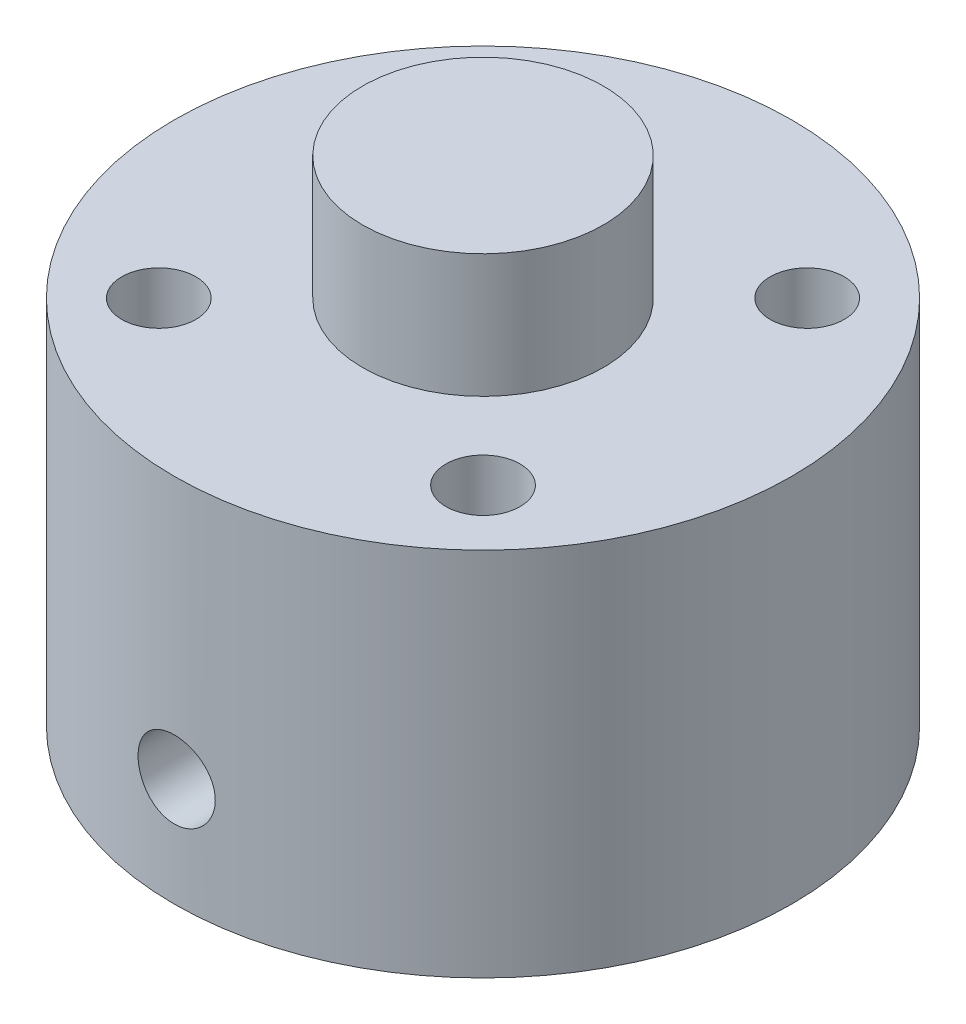
ISO-10303-21;
HEADER;
FILE_DESCRIPTION(('STEP AP214'),'2;1');
FILE_NAME('part.step','',(''),(''),'','','');
FILE_SCHEMA(('AUTOMOTIVE_DESIGN { 1 0 10303 214 1 1 1 1 }'));
ENDSEC;
DATA;
#1=APPLICATION_CONTEXT('core data for automotive mechanical design processes');
#2=APPLICATION_PROTOCOL_DEFINITION('international standard','automotive_design',2000,#1);
#3=PRODUCT_CONTEXT('',#1,'mechanical');
#4=PRODUCT('Part','Part','',(#3));
#5=PRODUCT_RELATED_PRODUCT_CATEGORY('part','',(#4));
#6=PRODUCT_DEFINITION_FORMATION('','',#4);
#7=PRODUCT_DEFINITION_CONTEXT('part definition',#1,'design');
#8=PRODUCT_DEFINITION('design','',#6,#7);
#9=PRODUCT_DEFINITION_SHAPE('','',#8);
#10=(LENGTH_UNIT() NAMED_UNIT(*) SI_UNIT(.MILLI.,.METRE.));
#11=(NAMED_UNIT(*) PLANE_ANGLE_UNIT() SI_UNIT($,.RADIAN.));
#12=(NAMED_UNIT(*) SI_UNIT($,.STERADIAN.) SOLID_ANGLE_UNIT());
#13=UNCERTAINTY_MEASURE_WITH_UNIT(LENGTH_MEASURE(1.E-05),#10,'distance_accuracy_value','');
#14=(GEOMETRIC_REPRESENTATION_CONTEXT(3) GLOBAL_UNCERTAINTY_ASSIGNED_CONTEXT((#13)) GLOBAL_UNIT_ASSIGNED_CONTEXT((#10,
#11,#12)) REPRESENTATION_CONTEXT('',''));
#15=CARTESIAN_POINT('',(0.,0.,0.));
#16=DIRECTION('',(0.,0.,1.));
#17=DIRECTION('',(1.,0.,0.));
#18=AXIS2_PLACEMENT_3D('',#15,#16,#17);
#19=CARTESIAN_POINT('',(0.,12.,0.));
#20=DIRECTION('',(0.,-1.,0.));
#21=DIRECTION('',(0.,0.,-1.));
#22=AXIS2_PLACEMENT_3D('',#19,#20,#21);
#23=CYLINDRICAL_SURFACE('',#22,10.);
#24=CARTESIAN_POINT('',(1.25,3.5,9.92156741649221));
#25=CARTESIAN_POINT('',(1.24999702741697,3.56991814189591,9.92156842085664));
#26=CARTESIAN_POINT('',(1.24411394951064,3.63987998245241,9.92231447559473));
#27=CARTESIAN_POINT('',(1.22073820686067,3.7778566127023,9.92521695489986));
#28=CARTESIAN_POINT('',(1.20323341054565,3.84586929024852,9.92737485321481));
#29=CARTESIAN_POINT('',(1.15713834641298,3.97792994105802,9.93285286887713));
#30=CARTESIAN_POINT('',(1.12855560239912,4.04198057105933,9.93617219726825));
#31=CARTESIAN_POINT('',(1.06113209921476,4.16436422591154,9.94359811759954));
#32=CARTESIAN_POINT('',(1.0222930936874,4.22269822587153,9.94770457492142));
#33=CARTESIAN_POINT('',(0.935226725132209,4.33233112356106,9.9562677962195));
#34=CARTESIAN_POINT('',(0.886953407512149,4.38359340115944,9.96072620851022));
#35=CARTESIAN_POINT('',(0.782487630335615,4.47731138446954,9.96947616437916));
#36=CARTESIAN_POINT('',(0.726294777029017,4.51976665204735,9.97376769964692));
#37=CARTESIAN_POINT('',(0.607354915337986,4.59479678975318,9.98171722306411));
#38=CARTESIAN_POINT('',(0.544586847780557,4.62733852254983,9.98537306923403));
#39=CARTESIAN_POINT('',(0.414423359027959,4.68140559997048,9.99162118477263));
#40=CARTESIAN_POINT('',(0.347028109680453,4.70293135346326,9.99421349361484));
#41=CARTESIAN_POINT('',(0.209897843875556,4.73424603416721,9.99803084353114));
#42=CARTESIAN_POINT('',(0.140176929831689,4.74409583926195,9.9992629741797));
#43=CARTESIAN_POINT('',(6.16003432730847E-05,4.75196769251827,10.0002453486461));
#44=CARTESIAN_POINT('',(-0.0703327884973858,4.74999020597627,9.99999565076039));
#45=CARTESIAN_POINT('',(-0.209382634487274,4.73431239862129,9.99804823885005));
#46=CARTESIAN_POINT('',(-0.278045602882227,4.72067755075931,9.99635861227864));
#47=CARTESIAN_POINT('',(-0.412101081952688,4.68217441168503,9.99173027971167));
#48=CARTESIAN_POINT('',(-0.477493530428103,4.65730590691659,9.98879154997023));
#49=CARTESIAN_POINT('',(-0.603354407719319,4.59697175360811,9.98198128903956));
#50=CARTESIAN_POINT('',(-0.663809113920259,4.56147777113491,9.97810726921619));
#51=CARTESIAN_POINT('',(-0.777928726153238,4.48092081889199,9.96985984532641));
#52=CARTESIAN_POINT('',(-0.831593320608679,4.43585741026571,9.96548641836132));
#53=CARTESIAN_POINT('',(-0.930994015386473,4.33707409070081,9.95669433761757));
#54=CARTESIAN_POINT('',(-0.976673419997999,4.28329712022667,9.95227557902364));
#55=CARTESIAN_POINT('',(-1.05836642531255,4.16880922160877,9.9439203597029));
#56=CARTESIAN_POINT('',(-1.09437999571755,4.10809827173097,9.9399839004879));
#57=CARTESIAN_POINT('',(-1.15572228679137,3.98141525221884,9.93303901306359));
#58=CARTESIAN_POINT('',(-1.18104646493116,3.9154409600234,9.93003097954066));
#59=CARTESIAN_POINT('',(-1.22024082723404,3.78013027323658,9.92529121247978));
#60=CARTESIAN_POINT('',(-1.23411156339981,3.71079404084564,9.92355941743351));
#61=CARTESIAN_POINT('',(-1.24993021595431,3.57122840900012,9.92157944392025));
#62=CARTESIAN_POINT('',(-1.25195792099914,3.5010081884556,9.92132133721188));
#63=CARTESIAN_POINT('',(-1.24424347661528,3.36122903516729,9.92229170559824));
#64=CARTESIAN_POINT('',(-1.2345015780549,3.29167008836034,9.92352014900725));
#65=CARTESIAN_POINT('',(-1.20359164289886,3.15542711821107,9.92731614241993));
#66=CARTESIAN_POINT('',(-1.18246224187303,3.0887341924048,9.92987916347331));
#67=CARTESIAN_POINT('',(-1.12941685955806,2.95983792257342,9.93605184985404));
#68=CARTESIAN_POINT('',(-1.09750049929061,2.89763473637957,9.93966155195382));
#69=CARTESIAN_POINT('',(-1.02359101107746,2.7791226780935,9.94754465676617));
#70=CARTESIAN_POINT('',(-0.981545559788554,2.72284666734279,9.95182146368541));
#71=CARTESIAN_POINT('',(-0.888645371184478,2.61812172303248,9.96054619775512));
#72=CARTESIAN_POINT('',(-0.837790291212742,2.56967309406601,9.96499413155644));
#73=CARTESIAN_POINT('',(-0.728365887779262,2.4816979063328,9.9735904434348));
#74=CARTESIAN_POINT('',(-0.669754246058518,2.4422237766025,9.97773696956261));
#75=CARTESIAN_POINT('',(-0.546686290840895,2.3736808911831,9.98523556515805));
#76=CARTESIAN_POINT('',(-0.482230095184162,2.34461192575951,9.98858765063858));
#77=CARTESIAN_POINT('',(-0.349476929569728,2.29779110654598,9.99411145326594));
#78=CARTESIAN_POINT('',(-0.28119078325589,2.28000895198419,9.99628632843852));
#79=CARTESIAN_POINT('',(-0.14257302863898,2.25616795538662,9.99922377338782));
#80=CARTESIAN_POINT('',(-0.0722415127190538,2.25010858470038,9.99998640685089));
#81=CARTESIAN_POINT('',(0.0679585916718919,2.24989503885392,10.0000131400683));
#82=CARTESIAN_POINT('',(0.137827068857367,2.25566001971601,9.9992874158392));
#83=CARTESIAN_POINT('',(0.275593870726307,2.27876030671542,9.99643920578969));
#84=CARTESIAN_POINT('',(0.343492196779925,2.29609560480588,9.99431672094073));
#85=CARTESIAN_POINT('',(0.475380721493658,2.34181905717485,9.98891242606017));
#86=CARTESIAN_POINT('',(0.539372280079786,2.37020333968661,9.98563102217235));
#87=CARTESIAN_POINT('',(0.661696668572012,2.43721065730378,9.9782722380314));
#88=CARTESIAN_POINT('',(0.720029431194015,2.47583381413085,9.97419484831559));
#89=CARTESIAN_POINT('',(0.829793383981279,2.56252160766819,9.96566596962789));
#90=CARTESIAN_POINT('',(0.88117689391715,2.61064639676183,9.9612122063946));
#91=CARTESIAN_POINT('',(0.975170559409673,2.71484647201443,9.95245079506771));
#92=CARTESIAN_POINT('',(1.01777863389675,2.77092363874545,9.94814318183499));
#93=CARTESIAN_POINT('',(1.09315262125802,2.88968496134868,9.94014405697344));
#94=CARTESIAN_POINT('',(1.12587989158337,2.95239379496754,9.93645498876141));
#95=CARTESIAN_POINT('',(1.18029264417168,3.08242837029738,9.93013929059811));
#96=CARTESIAN_POINT('',(1.20199013561416,3.1497489996517,9.92751150576939));
#97=CARTESIAN_POINT('',(1.22853294811899,3.26451499352177,9.92425393409921));
#98=CARTESIAN_POINT('',(1.23657151550529,3.31123647576879,9.92325150760955));
#99=CARTESIAN_POINT('',(1.24730602795276,3.40529862498346,9.92190791114956));
#100=CARTESIAN_POINT('',(1.25000201354966,3.45263928725048,9.92156673616213));
#101=CARTESIAN_POINT('',(1.25,3.5,9.92156741649221));
#102=B_SPLINE_CURVE_WITH_KNOTS('',3,(#24,#25,#26,#27,#28,#29,#30,#31,#32,#33,#34,#35,#36,#37,
#38,#39,#40,#41,#42,#43,#44,#45,#46,#47,#48,#49,#50,#51,#52,#53,#54,#55,#56,#57,#58,#59,#60,#61,
#62,#63,#64,#65,#66,#67,#68,#69,#70,#71,#72,#73,#74,#75,#76,#77,#78,#79,#80,#81,#82,#83,#84,#85,
#86,#87,#88,#89,#90,#91,#92,#93,#94,#95,#96,#97,#98,#99,#100,#101),.UNSPECIFIED.,.T.,.F.,(4,2,2,
2,2,2,2,2,2,2,2,2,2,2,2,2,2,2,2,2,2,2,2,2,2,2,2,2,2,2,2,2,2,2,2,2,2,2,4),(0.,0.209581408739619,
0.419381938076191,0.629040226290602,0.838662689753065,1.04933288774533,1.2600135637129,
1.4713909307287,1.68276045169915,1.89302298470729,2.10327724585054,2.31235832466519,
2.52144337835895,2.73109102206402,2.94074828234553,3.15183848688885,3.36292935309713,
3.57410983369505,3.78528013578094,3.99502608902942,4.20476757163558,4.41380188146367,
4.62284353605927,4.83298909772056,5.04314283497406,5.25449442946171,5.46584176354439,
5.67661928392471,5.88738729886406,6.09671908144128,6.30605071843395,6.51530906772045,
6.72456990482124,6.93520064445418,7.14588127719915,7.35737548852418,7.56863892991008,
7.71060494816475,7.85256988927737),.UNSPECIFIED.);
#103=CARTESIAN_POINT('',(1.25,3.5,9.92156741649221));
#104=VERTEX_POINT('',#103);
#105=EDGE_CURVE('E57',#104,#104,#102,.T.);
#106=ORIENTED_EDGE('',*,*,#105,.F.);
#107=EDGE_LOOP('',(#106));
#108=FACE_BOUND('',#107,.T.);
#109=CARTESIAN_POINT('',(0.,12.,0.));
#110=DIRECTION('',(0.,1.,0.));
#111=DIRECTION('',(0.,0.,1.));
#112=AXIS2_PLACEMENT_3D('',#109,#110,#111);
#113=CIRCLE('',#112,10.);
#114=CARTESIAN_POINT('',(0.,12.,10.));
#115=VERTEX_POINT('',#114);
#116=EDGE_CURVE('E10',#115,#115,#113,.T.);
#117=ORIENTED_EDGE('',*,*,#116,.F.);
#118=EDGE_LOOP('',(#117));
#119=FACE_BOUND('',#118,.T.);
#120=CARTESIAN_POINT('',(0.,0.,0.));
#121=DIRECTION('',(0.,1.,0.));
#122=DIRECTION('',(0.,0.,1.));
#123=AXIS2_PLACEMENT_3D('',#120,#121,#122);
#124=CIRCLE('',#123,10.);
#125=CARTESIAN_POINT('',(0.,0.,10.));
#126=VERTEX_POINT('',#125);
#127=EDGE_CURVE('E39',#126,#126,#124,.T.);
#128=ORIENTED_EDGE('',*,*,#127,.T.);
#129=EDGE_LOOP('',(#128));
#130=FACE_BOUND('',#129,.T.);
#131=ADVANCED_FACE('F36',(#108,#119,#130),#23,.T.);
#132=CARTESIAN_POINT('',(0.,12.,0.));
#133=DIRECTION('',(0.,1.,0.));
#134=DIRECTION('',(0.,0.,1.));
#135=AXIS2_PLACEMENT_3D('',#132,#133,#134);
#136=PLANE('',#135);
#137=CARTESIAN_POINT('',(5.25,12.,-5.25));
#138=DIRECTION('',(0.,1.,0.));
#139=DIRECTION('',(0.,0.,1.));
#140=AXIS2_PLACEMENT_3D('',#137,#138,#139);
#141=CIRCLE('',#140,1.2);
#142=CARTESIAN_POINT('',(5.25,12.,-4.05));
#143=VERTEX_POINT('',#142);
#144=EDGE_CURVE('E142',#143,#143,#141,.T.);
#145=ORIENTED_EDGE('',*,*,#144,.F.);
#146=EDGE_LOOP('',(#145));
#147=FACE_BOUND('',#146,.T.);
#148=CARTESIAN_POINT('',(5.25,12.,5.25));
#149=DIRECTION('',(0.,1.,0.));
#150=DIRECTION('',(0.,0.,-1.));
#151=AXIS2_PLACEMENT_3D('',#148,#149,#150);
#152=CIRCLE('',#151,1.2);
#153=CARTESIAN_POINT('',(5.25,12.,4.05));
#154=VERTEX_POINT('',#153);
#155=EDGE_CURVE('E136',#154,#154,#152,.T.);
#156=ORIENTED_EDGE('',*,*,#155,.F.);
#157=EDGE_LOOP('',(#156));
#158=FACE_BOUND('',#157,.T.);
#159=CARTESIAN_POINT('',(-5.25,12.,5.25));
#160=DIRECTION('',(0.,1.,0.));
#161=DIRECTION('',(0.,0.,-1.));
#162=AXIS2_PLACEMENT_3D('',#159,#160,#161);
#163=CIRCLE('',#162,1.2);
#164=CARTESIAN_POINT('',(-5.25,12.,4.05));
#165=VERTEX_POINT('',#164);
#166=EDGE_CURVE('E130',#165,#165,#163,.T.);
#167=ORIENTED_EDGE('',*,*,#166,.F.);
#168=EDGE_LOOP('',(#167));
#169=FACE_BOUND('',#168,.T.);
#170=CARTESIAN_POINT('',(-5.25,12.,-5.25));
#171=DIRECTION('',(0.,1.,0.));
#172=DIRECTION('',(0.,0.,1.));
#173=AXIS2_PLACEMENT_3D('',#170,#171,#172);
#174=CIRCLE('',#173,1.2);
#175=CARTESIAN_POINT('',(-5.25,12.,-4.05));
#176=VERTEX_POINT('',#175);
#177=EDGE_CURVE('E123',#176,#176,#174,.T.);
#178=ORIENTED_EDGE('',*,*,#177,.F.);
#179=EDGE_LOOP('',(#178));
#180=FACE_BOUND('',#179,.T.);
#181=CARTESIAN_POINT('',(0.,12.,0.));
#182=DIRECTION('',(0.,1.,0.));
#183=DIRECTION('',(0.,0.,1.));
#184=AXIS2_PLACEMENT_3D('',#181,#182,#183);
#185=CIRCLE('',#184,3.9);
#186=CARTESIAN_POINT('',(0.,12.,3.9));
#187=VERTEX_POINT('',#186);
#188=EDGE_CURVE('E48',#187,#187,#185,.T.);
#189=ORIENTED_EDGE('',*,*,#188,.F.);
#190=EDGE_LOOP('',(#189));
#191=FACE_BOUND('',#190,.T.);
#192=ORIENTED_EDGE('',*,*,#116,.T.);
#193=EDGE_LOOP('',(#192));
#194=FACE_BOUND('',#193,.T.);
#195=ADVANCED_FACE('F92',(#147,#158,#169,#180,#191,#194),#136,.T.);
#196=CARTESIAN_POINT('',(0.,0.,0.));
#197=DIRECTION('',(0.,1.,0.));
#198=DIRECTION('',(0.,0.,1.));
#199=AXIS2_PLACEMENT_3D('',#196,#197,#198);
#200=PLANE('',#199);
#201=CARTESIAN_POINT('',(0.,0.,0.));
#202=DIRECTION('',(0.,-1.,0.));
#203=DIRECTION('',(0.,0.,-1.));
#204=AXIS2_PLACEMENT_3D('',#201,#202,#203);
#205=CIRCLE('',#204,2.2);
#206=CARTESIAN_POINT('',(0.,0.,-2.2));
#207=VERTEX_POINT('',#206);
#208=EDGE_CURVE('E54',#207,#207,#205,.T.);
#209=ORIENTED_EDGE('',*,*,#208,.F.);
#210=EDGE_LOOP('',(#209));
#211=FACE_BOUND('',#210,.T.);
#212=ORIENTED_EDGE('',*,*,#127,.F.);
#213=EDGE_LOOP('',(#212));
#214=FACE_BOUND('',#213,.T.);
#215=ADVANCED_FACE('F90',(#211,#214),#200,.F.);
#216=CARTESIAN_POINT('',(0.,16.,0.));
#217=DIRECTION('',(0.,-1.,0.));
#218=DIRECTION('',(0.,0.,-1.));
#219=AXIS2_PLACEMENT_3D('',#216,#217,#218);
#220=CYLINDRICAL_SURFACE('',#219,3.9);
#221=CARTESIAN_POINT('',(0.,16.,0.));
#222=DIRECTION('',(0.,1.,0.));
#223=DIRECTION('',(0.,0.,1.));
#224=AXIS2_PLACEMENT_3D('',#221,#222,#223);
#225=CIRCLE('',#224,3.9);
#226=CARTESIAN_POINT('',(0.,16.,3.9));
#227=VERTEX_POINT('',#226);
#228=EDGE_CURVE('E46',#227,#227,#225,.T.);
#229=ORIENTED_EDGE('',*,*,#228,.F.);
#230=EDGE_LOOP('',(#229));
#231=FACE_BOUND('',#230,.T.);
#232=ORIENTED_EDGE('',*,*,#188,.T.);
#233=EDGE_LOOP('',(#232));
#234=FACE_BOUND('',#233,.T.);
#235=ADVANCED_FACE('F86',(#231,#234),#220,.T.);
#236=CARTESIAN_POINT('',(0.,16.,0.));
#237=DIRECTION('',(0.,1.,0.));
#238=DIRECTION('',(0.,0.,1.));
#239=AXIS2_PLACEMENT_3D('',#236,#237,#238);
#240=PLANE('',#239);
#241=ORIENTED_EDGE('',*,*,#228,.T.);
#242=EDGE_LOOP('',(#241));
#243=FACE_BOUND('',#242,.T.);
#244=ADVANCED_FACE('F82',(#243),#240,.T.);
#245=CARTESIAN_POINT('',(0.,8.,0.));
#246=DIRECTION('',(0.,-1.,0.));
#247=DIRECTION('',(0.,0.,-1.));
#248=AXIS2_PLACEMENT_3D('',#245,#246,#247);
#249=CYLINDRICAL_SURFACE('',#248,2.2);
#250=CARTESIAN_POINT('',(1.25,3.5,1.81038669902317));
#251=CARTESIAN_POINT('',(1.24999835739887,3.4363238138607,1.81038921667114));
#252=CARTESIAN_POINT('',(1.24510388975407,3.37263567037628,1.81379695747038));
#253=CARTESIAN_POINT('',(1.22584487760749,3.24734826488673,1.8268639951984));
#254=CARTESIAN_POINT('',(1.21147009310439,3.18575133740267,1.83653005173272));
#255=CARTESIAN_POINT('',(1.17414628645356,3.06669626384151,1.86060865090484));
#256=CARTESIAN_POINT('',(1.15125228309859,3.00921432302108,1.8749906676241));
#257=CARTESIAN_POINT('',(1.09771399217154,2.89892914056057,1.906827771035));
#258=CARTESIAN_POINT('',(1.06706723466083,2.84612739723087,1.92428383654377));
#259=CARTESIAN_POINT('',(0.995013450191782,2.74041354335209,1.96259669630164));
#260=CARTESIAN_POINT('',(0.952800039415243,2.68811015921611,1.98361700286465));
#261=CARTESIAN_POINT('',(0.860472342863963,2.59083107629947,2.02537829212673));
#262=CARTESIAN_POINT('',(0.810353035652175,2.54586007185671,2.04611908814442));
#263=CARTESIAN_POINT('',(0.697940214398993,2.46037704898787,2.0872910131191));
#264=CARTESIAN_POINT('',(0.634946693969555,2.42067451337662,2.107512055782));
#265=CARTESIAN_POINT('',(0.50180744903722,2.35271594758618,2.14311025652829));
#266=CARTESIAN_POINT('',(0.431667625003813,2.32445056847031,2.15849136856148));
#267=CARTESIAN_POINT('',(0.292726748850643,2.28279014245527,2.18147340639044));
#268=CARTESIAN_POINT('',(0.224346829620778,2.2683091993886,2.18963792593527));
#269=CARTESIAN_POINT('',(0.0856860912697917,2.25098936658369,2.19942571120894));
#270=CARTESIAN_POINT('',(0.0154068744698598,2.24814095392424,2.20105432750806));
#271=CARTESIAN_POINT('',(-0.116621834889842,2.25389697474595,2.19778795208595));
#272=CARTESIAN_POINT('',(-0.178448325750607,2.26125931766431,2.19360038595412));
#273=CARTESIAN_POINT('',(-0.299814031149077,2.28491405478796,2.18032978246281));
#274=CARTESIAN_POINT('',(-0.359353077227736,2.30120710535203,2.17124638528699));
#275=CARTESIAN_POINT('',(-0.475224774172259,2.34221058375113,2.14887863391571));
#276=CARTESIAN_POINT('',(-0.531522928974997,2.36699699285057,2.13555643927109));
#277=CARTESIAN_POINT('',(-0.639257325134587,2.42409522299851,2.10581994105908));
#278=CARTESIAN_POINT('',(-0.690692108083202,2.45640929141226,2.08940471435444));
#279=CARTESIAN_POINT('',(-0.793421670492395,2.53176260193741,2.05274927109886));
#280=CARTESIAN_POINT('',(-0.844052371583292,2.57559866908234,2.03228652896342));
#281=CARTESIAN_POINT('',(-0.937649598559088,2.67068011506731,1.99083888709232));
#282=CARTESIAN_POINT('',(-0.980606836179458,2.72193433916823,1.96985338911933));
#283=CARTESIAN_POINT('',(-1.06184912793005,2.83639419201573,1.92737529916901));
#284=CARTESIAN_POINT('',(-1.09926578818394,2.90027851431146,1.90603399462802));
#285=CARTESIAN_POINT('',(-1.16257349113033,3.03478808441984,1.86809942015846));
#286=CARTESIAN_POINT('',(-1.18848481988638,3.10540119885137,1.85149781186179));
#287=CARTESIAN_POINT('',(-1.22295547791269,3.23486597796105,1.82885315113174));
#288=CARTESIAN_POINT('',(-1.23411640489027,3.29275654966354,1.8212699181045));
#289=CARTESIAN_POINT('',(-1.24814632214432,3.40996955607789,1.81168641868008));
#290=CARTESIAN_POINT('',(-1.25102308681233,3.46929059558023,1.80968091784023));
#291=CARTESIAN_POINT('',(-1.24832791792425,3.58767042378121,1.81154049957966));
#292=CARTESIAN_POINT('',(-1.24275163181954,3.64672906166024,1.8154086065319));
#293=CARTESIAN_POINT('',(-1.2234600215949,3.76290502839006,1.82846297108607));
#294=CARTESIAN_POINT('',(-1.20973883008719,3.82002092634747,1.8376530623968));
#295=CARTESIAN_POINT('',(-1.17454477162297,3.93177189489216,1.86034527003511));
#296=CARTESIAN_POINT('',(-1.15296713208268,3.98636162570113,1.87390536921283));
#297=CARTESIAN_POINT('',(-1.10280370760556,4.0913665043642,1.90385824445292));
#298=CARTESIAN_POINT('',(-1.07421504031912,4.14177992383489,1.92025218473412));
#299=CARTESIAN_POINT('',(-1.00539643264757,4.24577399407568,1.95727930330246));
#300=CARTESIAN_POINT('',(-0.964025020106908,4.29851085870438,1.97816616082744));
#301=CARTESIAN_POINT('',(-0.873361171670031,4.39678026324142,2.01983483865761));
#302=CARTESIAN_POINT('',(-0.824062311987475,4.44230690065043,2.04061655956124));
#303=CARTESIAN_POINT('',(-0.71315860821645,4.52923901090227,2.08212290758651));
#304=CARTESIAN_POINT('',(-0.65082463524235,4.56981965309821,2.1026474970986));
#305=CARTESIAN_POINT('',(-0.518867067056716,4.63966475303189,2.13902921652673));
#306=CARTESIAN_POINT('',(-0.449249354113344,4.66893825400185,2.15489007397101));
#307=CARTESIAN_POINT('',(-0.310702276705928,4.71276541585022,2.17898921996996));
#308=CARTESIAN_POINT('',(-0.242185557616189,4.72833017424458,2.18774636923525));
#309=CARTESIAN_POINT('',(-0.103014831198712,4.74772247266944,2.19869144717743));
#310=CARTESIAN_POINT('',(-0.0323627121907292,4.75156009299898,2.20088501767758));
#311=CARTESIAN_POINT('',(0.100353406750901,4.74752778442961,2.19859666785343));
#312=CARTESIAN_POINT('',(0.162474681001058,4.74094777006611,2.1948501689671));
#313=CARTESIAN_POINT('',(0.284557331233411,4.71876001341163,2.18238210499599));
#314=CARTESIAN_POINT('',(0.344518585939221,4.70315176505832,2.17366026102706));
#315=CARTESIAN_POINT('',(0.46098528140345,4.66352598823784,2.15197999129237));
#316=CARTESIAN_POINT('',(0.517478240081093,4.63947996450315,2.13900721963941));
#317=CARTESIAN_POINT('',(0.625706636168766,4.58383475473992,2.10989008925837));
#318=CARTESIAN_POINT('',(0.677440734315729,4.55223345141633,2.0937448417005));
#319=CARTESIAN_POINT('',(0.780774094838817,4.47844460398236,2.05759731991023));
#320=CARTESIAN_POINT('',(0.831734950055208,4.43547571089163,2.03736619477788));
#321=CARTESIAN_POINT('',(0.926132656370717,4.34213546470979,1.99623040147782));
#322=CARTESIAN_POINT('',(0.969560397863677,4.29175528346096,1.97532495358503));
#323=CARTESIAN_POINT('',(1.05211926850635,4.17891039485417,1.93272201583285));
#324=CARTESIAN_POINT('',(1.09036078995313,4.11573728572496,1.91116111419153));
#325=CARTESIAN_POINT('',(1.15546952392587,3.98255514867589,1.87252044813175));
#326=CARTESIAN_POINT('',(1.18235648328963,3.91255825128661,1.85543292385791));
#327=CARTESIAN_POINT('',(1.21832035193396,3.78536036401022,1.83194911443707));
#328=CARTESIAN_POINT('',(1.23014744887432,3.72922879738721,1.82395884676622));
#329=CARTESIAN_POINT('',(1.24598474434705,3.61540052600939,1.81317867556741));
#330=CARTESIAN_POINT('',(1.25000148857191,3.55770517298981,1.81038441745889));
#331=CARTESIAN_POINT('',(1.25,3.5,1.81038669902317));
#332=B_SPLINE_CURVE_WITH_KNOTS('',3,(#250,#251,#252,#253,#254,#255,#256,#257,#258,#259,#260,
#261,#262,#263,#264,#265,#266,#267,#268,#269,#270,#271,#272,#273,#274,#275,#276,#277,#278,#279,
#280,#281,#282,#283,#284,#285,#286,#287,#288,#289,#290,#291,#292,#293,#294,#295,#296,#297,#298,
#299,#300,#301,#302,#303,#304,#305,#306,#307,#308,#309,#310,#311,#312,#313,#314,#315,#316,#317,
#318,#319,#320,#321,#322,#323,#324,#325,#326,#327,#328,#329,#330,#331),.UNSPECIFIED.,.T.,.F.,(4,
2,2,2,2,2,2,2,2,2,2,2,2,2,2,2,2,2,2,2,2,2,2,2,2,2,2,2,2,2,2,2,2,2,2,2,2,2,2,2,4),(0.,
0.190787404026883,0.38178122203907,0.571562387295552,0.761404090969659,0.971828656573862,
1.18238741570561,1.41262392489842,1.64267185259559,1.85256394475256,2.0622841751608,
2.24861070477366,2.43495093021683,2.62300365939815,2.81111260340054,3.02034130671986,
3.22982157749875,3.45979823364773,3.68936777170693,3.86691201696718,4.044289588885,
4.22175852507044,4.39935546088792,4.57941317221007,4.75954503270051,4.96931658293563,
5.17925898032015,5.40951254219681,5.63958156854252,5.85076392270588,6.06176469966564,
6.24861149331419,6.43546876135757,6.62296323781432,6.81051031952686,7.0186483387053,
7.22703632541744,7.45667245731568,7.6859075653797,7.85894962890344,8.03184660689713),.UNSPECIFIED.);
#333=CARTESIAN_POINT('',(1.25,3.5,1.81038669902317));
#334=VERTEX_POINT('',#333);
#335=EDGE_CURVE('E66',#334,#334,#332,.T.);
#336=ORIENTED_EDGE('',*,*,#335,.F.);
#337=EDGE_LOOP('',(#336));
#338=FACE_BOUND('',#337,.T.);
#339=CARTESIAN_POINT('',(0.,8.,0.));
#340=DIRECTION('',(0.,-1.,0.));
#341=DIRECTION('',(0.,0.,-1.));
#342=AXIS2_PLACEMENT_3D('',#339,#340,#341);
#343=CIRCLE('',#342,2.2);
#344=CARTESIAN_POINT('',(0.,8.,-2.2));
#345=VERTEX_POINT('',#344);
#346=EDGE_CURVE('E51',#345,#345,#343,.T.);
#347=ORIENTED_EDGE('',*,*,#346,.F.);
#348=EDGE_LOOP('',(#347));
#349=FACE_BOUND('',#348,.T.);
#350=ORIENTED_EDGE('',*,*,#208,.T.);
#351=EDGE_LOOP('',(#350));
#352=FACE_BOUND('',#351,.T.);
#353=ADVANCED_FACE('F78',(#338,#349,#352),#249,.F.);
#354=CARTESIAN_POINT('',(0.,8.,0.));
#355=DIRECTION('',(0.,-1.,0.));
#356=DIRECTION('',(0.,0.,-1.));
#357=AXIS2_PLACEMENT_3D('',#354,#355,#356);
#358=PLANE('',#357);
#359=ORIENTED_EDGE('',*,*,#346,.T.);
#360=EDGE_LOOP('',(#359));
#361=FACE_BOUND('',#360,.T.);
#362=ADVANCED_FACE('F75',(#361),#358,.T.);
#363=CARTESIAN_POINT('',(0.,3.5,-10.001));
#364=DIRECTION('',(0.,0.,1.));
#365=DIRECTION('',(1.,0.,0.));
#366=AXIS2_PLACEMENT_3D('',#363,#364,#365);
#367=CYLINDRICAL_SURFACE('',#366,1.25);
#368=ORIENTED_EDGE('',*,*,#335,.T.);
#369=EDGE_LOOP('',(#368));
#370=FACE_BOUND('',#369,.T.);
#371=ORIENTED_EDGE('',*,*,#105,.T.);
#372=EDGE_LOOP('',(#371));
#373=FACE_BOUND('',#372,.T.);
#374=ADVANCED_FACE('F71',(#370,#373),#367,.F.);
#375=CARTESIAN_POINT('',(-5.25,3.,-5.25));
#376=DIRECTION('',(0.,1.,0.));
#377=DIRECTION('',(0.,0.,1.));
#378=AXIS2_PLACEMENT_3D('',#375,#376,#377);
#379=CYLINDRICAL_SURFACE('',#378,1.2);
#380=CARTESIAN_POINT('',(-5.25,3.,-5.25));
#381=DIRECTION('',(0.,1.,0.));
#382=DIRECTION('',(0.,0.,1.));
#383=AXIS2_PLACEMENT_3D('',#380,#381,#382);
#384=CIRCLE('',#383,1.2);
#385=CARTESIAN_POINT('',(-5.25,3.,-4.05));
#386=VERTEX_POINT('',#385);
#387=EDGE_CURVE('E121',#386,#386,#384,.T.);
#388=ORIENTED_EDGE('',*,*,#387,.F.);
#389=EDGE_LOOP('',(#388));
#390=FACE_BOUND('',#389,.T.);
#391=ORIENTED_EDGE('',*,*,#177,.T.);
#392=EDGE_LOOP('',(#391));
#393=FACE_BOUND('',#392,.T.);
#394=ADVANCED_FACE('F111',(#390,#393),#379,.F.);
#395=CARTESIAN_POINT('',(-5.25,3.,-5.25));
#396=DIRECTION('',(0.,1.,0.));
#397=DIRECTION('',(0.,0.,1.));
#398=AXIS2_PLACEMENT_3D('',#395,#396,#397);
#399=PLANE('',#398);
#400=ORIENTED_EDGE('',*,*,#387,.T.);
#401=EDGE_LOOP('',(#400));
#402=FACE_BOUND('',#401,.T.);
#403=ADVANCED_FACE('F116',(#402),#399,.T.);
#404=CARTESIAN_POINT('',(-5.25,3.,5.25));
#405=DIRECTION('',(0.,1.,0.));
#406=DIRECTION('',(0.,0.,1.));
#407=AXIS2_PLACEMENT_3D('',#404,#405,#406);
#408=CYLINDRICAL_SURFACE('',#407,1.2);
#409=CARTESIAN_POINT('',(-5.25,3.,5.25));
#410=DIRECTION('',(0.,1.,0.));
#411=DIRECTION('',(0.,0.,-1.));
#412=AXIS2_PLACEMENT_3D('',#409,#410,#411);
#413=CIRCLE('',#412,1.2);
#414=CARTESIAN_POINT('',(-5.25,3.,4.05));
#415=VERTEX_POINT('',#414);
#416=EDGE_CURVE('E133',#415,#415,#413,.T.);
#417=ORIENTED_EDGE('',*,*,#416,.F.);
#418=EDGE_LOOP('',(#417));
#419=FACE_BOUND('',#418,.T.);
#420=ORIENTED_EDGE('',*,*,#166,.T.);
#421=EDGE_LOOP('',(#420));
#422=FACE_BOUND('',#421,.T.);
#423=ADVANCED_FACE('F167',(#419,#422),#408,.F.);
#424=CARTESIAN_POINT('',(-5.25,3.,5.25));
#425=DIRECTION('',(0.,-1.,0.));
#426=DIRECTION('',(0.,0.,-1.));
#427=AXIS2_PLACEMENT_3D('',#424,#425,#426);
#428=PLANE('',#427);
#429=ORIENTED_EDGE('',*,*,#416,.T.);
#430=EDGE_LOOP('',(#429));
#431=FACE_BOUND('',#430,.T.);
#432=ADVANCED_FACE('F169',(#431),#428,.F.);
#433=CARTESIAN_POINT('',(5.25,3.,5.25));
#434=DIRECTION('',(0.,1.,0.));
#435=DIRECTION('',(0.,0.,1.));
#436=AXIS2_PLACEMENT_3D('',#433,#434,#435);
#437=CYLINDRICAL_SURFACE('',#436,1.2);
#438=CARTESIAN_POINT('',(5.25,3.,5.25));
#439=DIRECTION('',(0.,1.,0.));
#440=DIRECTION('',(0.,0.,-1.));
#441=AXIS2_PLACEMENT_3D('',#438,#439,#440);
#442=CIRCLE('',#441,1.2);
#443=CARTESIAN_POINT('',(5.25,3.,4.05));
#444=VERTEX_POINT('',#443);
#445=EDGE_CURVE('E139',#444,#444,#442,.T.);
#446=ORIENTED_EDGE('',*,*,#445,.F.);
#447=EDGE_LOOP('',(#446));
#448=FACE_BOUND('',#447,.T.);
#449=ORIENTED_EDGE('',*,*,#155,.T.);
#450=EDGE_LOOP('',(#449));
#451=FACE_BOUND('',#450,.T.);
#452=ADVANCED_FACE('F176',(#448,#451),#437,.F.);
#453=CARTESIAN_POINT('',(5.25,3.,5.25));
#454=DIRECTION('',(0.,-1.,0.));
#455=DIRECTION('',(0.,0.,-1.));
#456=AXIS2_PLACEMENT_3D('',#453,#454,#455);
#457=PLANE('',#456);
#458=ORIENTED_EDGE('',*,*,#445,.T.);
#459=EDGE_LOOP('',(#458));
#460=FACE_BOUND('',#459,.T.);
#461=ADVANCED_FACE('F153',(#460),#457,.F.);
#462=CARTESIAN_POINT('',(5.25,3.,-5.25));
#463=DIRECTION('',(0.,1.,0.));
#464=DIRECTION('',(0.,0.,1.));
#465=AXIS2_PLACEMENT_3D('',#462,#463,#464);
#466=CYLINDRICAL_SURFACE('',#465,1.2);
#467=CARTESIAN_POINT('',(5.25,3.,-5.25));
#468=DIRECTION('',(0.,1.,0.));
#469=DIRECTION('',(0.,0.,1.));
#470=AXIS2_PLACEMENT_3D('',#467,#468,#469);
#471=CIRCLE('',#470,1.2);
#472=CARTESIAN_POINT('',(5.25,3.,-4.05));
#473=VERTEX_POINT('',#472);
#474=EDGE_CURVE('E128',#473,#473,#471,.T.);
#475=ORIENTED_EDGE('',*,*,#474,.F.);
#476=EDGE_LOOP('',(#475));
#477=FACE_BOUND('',#476,.T.);
#478=ORIENTED_EDGE('',*,*,#144,.T.);
#479=EDGE_LOOP('',(#478));
#480=FACE_BOUND('',#479,.T.);
#481=ADVANCED_FACE('F150',(#477,#480),#466,.F.);
#482=CARTESIAN_POINT('',(5.25,3.,-5.25));
#483=DIRECTION('',(0.,1.,0.));
#484=DIRECTION('',(0.,0.,1.));
#485=AXIS2_PLACEMENT_3D('',#482,#483,#484);
#486=PLANE('',#485);
#487=ORIENTED_EDGE('',*,*,#474,.T.);
#488=EDGE_LOOP('',(#487));
#489=FACE_BOUND('',#488,.T.);
#490=ADVANCED_FACE('F148',(#489),#486,.T.);
#491=CLOSED_SHELL('',(#131,#195,#215,#235,#244,#353,#362,#374,#394,#403,#423,#432,#452,#461,
#481,#490));
#492=MANIFOLD_SOLID_BREP('B2',#491);
#493=ADVANCED_BREP_SHAPE_REPRESENTATION('',(#18,#492),#14);
#494=SHAPE_DEFINITION_REPRESENTATION(#9,#493);
ENDSEC;
END-ISO-10303-21;
